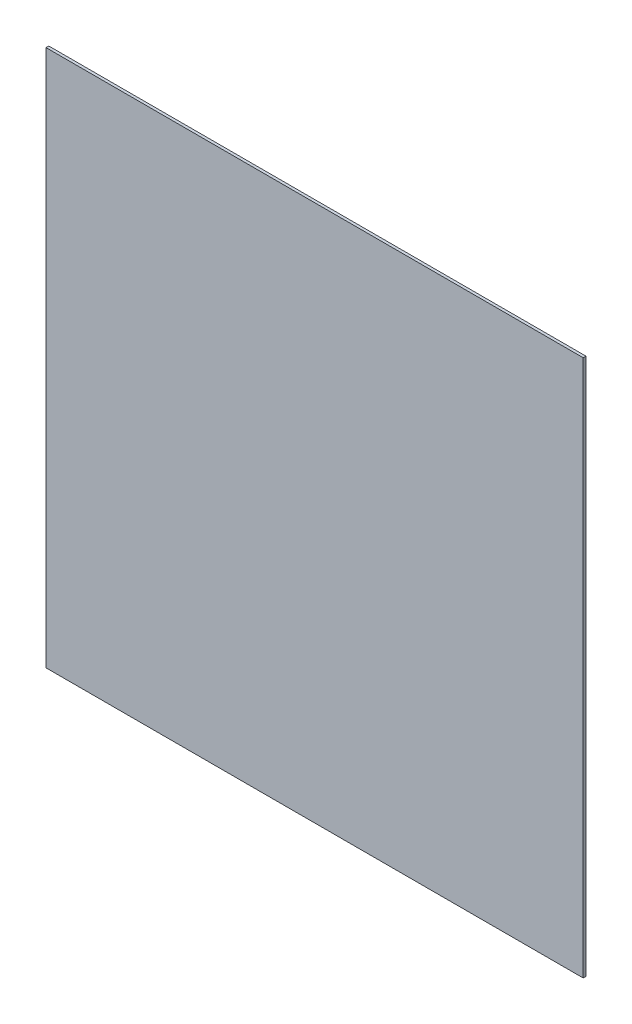
ISO-10303-21;
HEADER;
FILE_DESCRIPTION(('STEP AP214'),'2;1');
FILE_NAME('part.step','',(''),(''),'','','');
FILE_SCHEMA(('AUTOMOTIVE_DESIGN { 1 0 10303 214 1 1 1 1 }'));
ENDSEC;
DATA;
#1=APPLICATION_CONTEXT('core data for automotive mechanical design processes');
#2=APPLICATION_PROTOCOL_DEFINITION('international standard','automotive_design',2000,#1);
#3=PRODUCT_CONTEXT('',#1,'mechanical');
#4=PRODUCT('Part','Part','',(#3));
#5=PRODUCT_RELATED_PRODUCT_CATEGORY('part','',(#4));
#6=PRODUCT_DEFINITION_FORMATION('','',#4);
#7=PRODUCT_DEFINITION_CONTEXT('part definition',#1,'design');
#8=PRODUCT_DEFINITION('design','',#6,#7);
#9=PRODUCT_DEFINITION_SHAPE('','',#8);
#10=(LENGTH_UNIT() NAMED_UNIT(*) SI_UNIT(.MILLI.,.METRE.));
#11=(NAMED_UNIT(*) PLANE_ANGLE_UNIT() SI_UNIT($,.RADIAN.));
#12=(NAMED_UNIT(*) SI_UNIT($,.STERADIAN.) SOLID_ANGLE_UNIT());
#13=UNCERTAINTY_MEASURE_WITH_UNIT(LENGTH_MEASURE(1.E-05),#10,'distance_accuracy_value','');
#14=(GEOMETRIC_REPRESENTATION_CONTEXT(3) GLOBAL_UNCERTAINTY_ASSIGNED_CONTEXT((#13)) GLOBAL_UNIT_ASSIGNED_CONTEXT((#10,
#11,#12)) REPRESENTATION_CONTEXT('',''));
#15=CARTESIAN_POINT('',(0.,0.,0.));
#16=DIRECTION('',(0.,0.,1.));
#17=DIRECTION('',(1.,0.,0.));
#18=AXIS2_PLACEMENT_3D('',#15,#16,#17);
#19=CARTESIAN_POINT('',(194.,194.,0.));
#20=DIRECTION('',(0.,0.,1.));
#21=DIRECTION('',(1.,0.,0.));
#22=AXIS2_PLACEMENT_3D('',#19,#20,#21);
#23=PLANE('',#22);
#24=DIRECTION('',(0.,1.,0.));
#25=VECTOR('',#24,1.);
#26=CARTESIAN_POINT('',(0.,388.,0.));
#27=LINE('',#26,#25);
#28=CARTESIAN_POINT('',(0.,388.,0.));
#29=VERTEX_POINT('',#28);
#30=CARTESIAN_POINT('',(0.,0.,0.));
#31=VERTEX_POINT('',#30);
#32=EDGE_CURVE('E87',#29,#31,#27,.F.);
#33=ORIENTED_EDGE('',*,*,#32,.F.);
#34=DIRECTION('',(1.,0.,0.));
#35=VECTOR('',#34,1.);
#36=CARTESIAN_POINT('',(388.,388.,0.));
#37=LINE('',#36,#35);
#38=CARTESIAN_POINT('',(388.,388.,0.));
#39=VERTEX_POINT('',#38);
#40=EDGE_CURVE('E56',#39,#29,#37,.F.);
#41=ORIENTED_EDGE('',*,*,#40,.F.);
#42=DIRECTION('',(0.,1.,0.));
#43=VECTOR('',#42,1.);
#44=CARTESIAN_POINT('',(388.,0.,0.));
#45=LINE('',#44,#43);
#46=CARTESIAN_POINT('',(388.,0.,0.));
#47=VERTEX_POINT('',#46);
#48=EDGE_CURVE('E58',#47,#39,#45,.T.);
#49=ORIENTED_EDGE('',*,*,#48,.F.);
#50=DIRECTION('',(1.,0.,0.));
#51=VECTOR('',#50,1.);
#52=CARTESIAN_POINT('',(0.,0.,0.));
#53=LINE('',#52,#51);
#54=EDGE_CURVE('E20',#31,#47,#53,.T.);
#55=ORIENTED_EDGE('',*,*,#54,.F.);
#56=EDGE_LOOP('',(#33,#41,#49,#55));
#57=FACE_BOUND('',#56,.T.);
#58=ADVANCED_FACE('F17',(#57),#23,.F.);
#59=CARTESIAN_POINT('',(0.,0.,0.));
#60=DIRECTION('',(0.,-1.,0.));
#61=DIRECTION('',(0.,0.,-1.));
#62=AXIS2_PLACEMENT_3D('',#59,#60,#61);
#63=PLANE('',#62);
#64=DIRECTION('',(1.,0.,0.));
#65=VECTOR('',#64,1.);
#66=CARTESIAN_POINT('',(194.,0.,2.));
#67=LINE('',#66,#65);
#68=CARTESIAN_POINT('',(0.,0.,2.));
#69=VERTEX_POINT('',#68);
#70=CARTESIAN_POINT('',(388.,0.,2.));
#71=VERTEX_POINT('',#70);
#72=EDGE_CURVE('E94',#69,#71,#67,.T.);
#73=ORIENTED_EDGE('',*,*,#72,.F.);
#74=DIRECTION('',(0.,0.,1.));
#75=VECTOR('',#74,1.);
#76=CARTESIAN_POINT('',(0.,0.,0.));
#77=LINE('',#76,#75);
#78=EDGE_CURVE('E70',#31,#69,#77,.T.);
#79=ORIENTED_EDGE('',*,*,#78,.F.);
#80=ORIENTED_EDGE('',*,*,#54,.T.);
#81=DIRECTION('',(0.,0.,-1.));
#82=VECTOR('',#81,1.);
#83=CARTESIAN_POINT('',(388.,0.,0.));
#84=LINE('',#83,#82);
#85=EDGE_CURVE('E65',#71,#47,#84,.T.);
#86=ORIENTED_EDGE('',*,*,#85,.F.);
#87=EDGE_LOOP('',(#73,#79,#80,#86));
#88=FACE_BOUND('',#87,.T.);
#89=ADVANCED_FACE('F67',(#88),#63,.T.);
#90=CARTESIAN_POINT('',(388.,0.,0.));
#91=DIRECTION('',(1.,0.,0.));
#92=DIRECTION('',(0.,0.,-1.));
#93=AXIS2_PLACEMENT_3D('',#90,#91,#92);
#94=PLANE('',#93);
#95=DIRECTION('',(0.,1.,0.));
#96=VECTOR('',#95,1.);
#97=CARTESIAN_POINT('',(388.,194.,2.));
#98=LINE('',#97,#96);
#99=CARTESIAN_POINT('',(388.,388.,2.));
#100=VERTEX_POINT('',#99);
#101=EDGE_CURVE('E75',#71,#100,#98,.T.);
#102=ORIENTED_EDGE('',*,*,#101,.F.);
#103=ORIENTED_EDGE('',*,*,#85,.T.);
#104=ORIENTED_EDGE('',*,*,#48,.T.);
#105=DIRECTION('',(0.,0.,1.));
#106=VECTOR('',#105,1.);
#107=CARTESIAN_POINT('',(388.,388.,0.));
#108=LINE('',#107,#106);
#109=EDGE_CURVE('E82',#100,#39,#108,.F.);
#110=ORIENTED_EDGE('',*,*,#109,.F.);
#111=EDGE_LOOP('',(#102,#103,#104,#110));
#112=FACE_BOUND('',#111,.T.);
#113=ADVANCED_FACE('F73',(#112),#94,.T.);
#114=CARTESIAN_POINT('',(388.,388.,0.));
#115=DIRECTION('',(0.,1.,0.));
#116=DIRECTION('',(0.,0.,1.));
#117=AXIS2_PLACEMENT_3D('',#114,#115,#116);
#118=PLANE('',#117);
#119=DIRECTION('',(1.,0.,0.));
#120=VECTOR('',#119,1.);
#121=CARTESIAN_POINT('',(194.,388.,2.));
#122=LINE('',#121,#120);
#123=CARTESIAN_POINT('',(0.,388.,2.));
#124=VERTEX_POINT('',#123);
#125=EDGE_CURVE('E27',#100,#124,#122,.F.);
#126=ORIENTED_EDGE('',*,*,#125,.F.);
#127=ORIENTED_EDGE('',*,*,#109,.T.);
#128=ORIENTED_EDGE('',*,*,#40,.T.);
#129=DIRECTION('',(0.,0.,1.));
#130=VECTOR('',#129,1.);
#131=CARTESIAN_POINT('',(0.,388.,0.));
#132=LINE('',#131,#130);
#133=EDGE_CURVE('E36',#124,#29,#132,.F.);
#134=ORIENTED_EDGE('',*,*,#133,.F.);
#135=EDGE_LOOP('',(#126,#127,#128,#134));
#136=FACE_BOUND('',#135,.T.);
#137=ADVANCED_FACE('F102',(#136),#118,.T.);
#138=CARTESIAN_POINT('',(0.,388.,0.));
#139=DIRECTION('',(-1.,0.,0.));
#140=DIRECTION('',(0.,0.,1.));
#141=AXIS2_PLACEMENT_3D('',#138,#139,#140);
#142=PLANE('',#141);
#143=DIRECTION('',(0.,1.,0.));
#144=VECTOR('',#143,1.);
#145=CARTESIAN_POINT('',(0.,194.,2.));
#146=LINE('',#145,#144);
#147=EDGE_CURVE('E11',#124,#69,#146,.F.);
#148=ORIENTED_EDGE('',*,*,#147,.F.);
#149=ORIENTED_EDGE('',*,*,#133,.T.);
#150=ORIENTED_EDGE('',*,*,#32,.T.);
#151=ORIENTED_EDGE('',*,*,#78,.T.);
#152=EDGE_LOOP('',(#148,#149,#150,#151));
#153=FACE_BOUND('',#152,.T.);
#154=ADVANCED_FACE('F104',(#153),#142,.T.);
#155=CARTESIAN_POINT('',(194.,194.,2.));
#156=DIRECTION('',(0.,0.,1.));
#157=DIRECTION('',(1.,0.,0.));
#158=AXIS2_PLACEMENT_3D('',#155,#156,#157);
#159=PLANE('',#158);
#160=ORIENTED_EDGE('',*,*,#125,.T.);
#161=ORIENTED_EDGE('',*,*,#147,.T.);
#162=ORIENTED_EDGE('',*,*,#72,.T.);
#163=ORIENTED_EDGE('',*,*,#101,.T.);
#164=EDGE_LOOP('',(#160,#161,#162,#163));
#165=FACE_BOUND('',#164,.T.);
#166=ADVANCED_FACE('F101',(#165),#159,.T.);
#167=CLOSED_SHELL('',(#58,#89,#113,#137,#154,#166));
#168=MANIFOLD_SOLID_BREP('B1',#167);
#169=ADVANCED_BREP_SHAPE_REPRESENTATION('',(#18,#168),#14);
#170=SHAPE_DEFINITION_REPRESENTATION(#9,#169);
ENDSEC;
END-ISO-10303-21;
